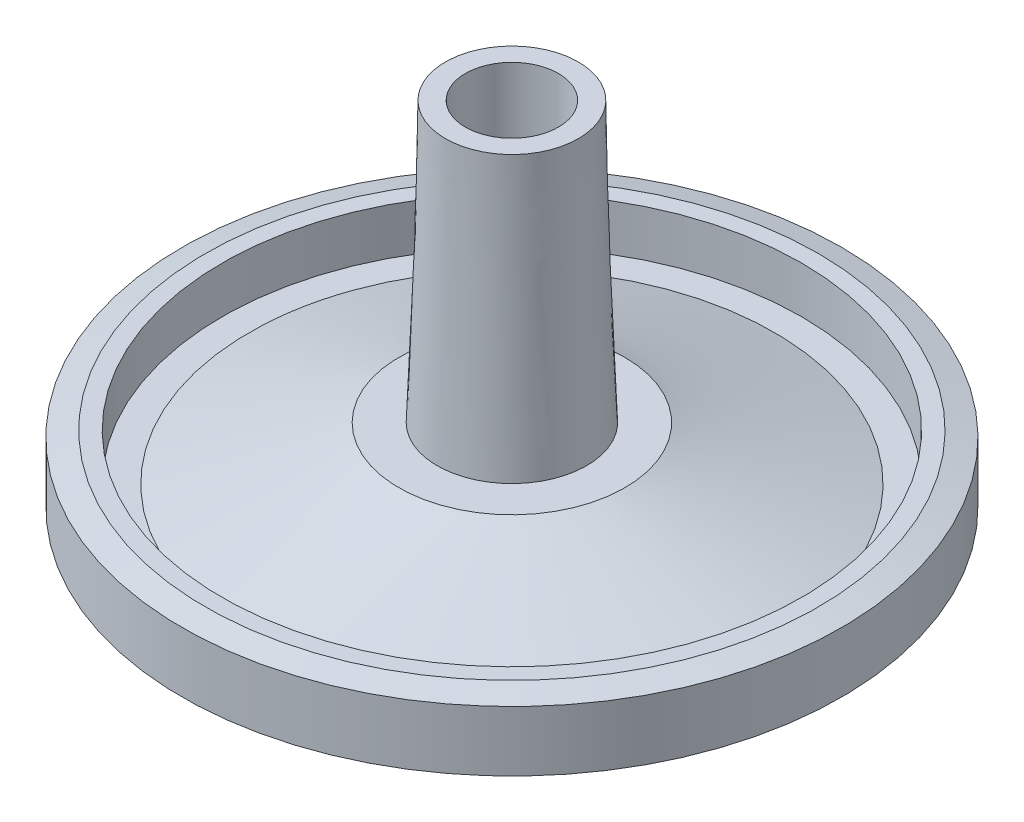
ISO-10303-21;
HEADER;
FILE_DESCRIPTION(('STEP AP214'),'2;1');
FILE_NAME('part.step','',(''),(''),'','','');
FILE_SCHEMA(('AUTOMOTIVE_DESIGN { 1 0 10303 214 1 1 1 1 }'));
ENDSEC;
DATA;
#1=APPLICATION_CONTEXT('core data for automotive mechanical design processes');
#2=APPLICATION_PROTOCOL_DEFINITION('international standard','automotive_design',2000,#1);
#3=PRODUCT_CONTEXT('',#1,'mechanical');
#4=PRODUCT('Part','Part','',(#3));
#5=PRODUCT_RELATED_PRODUCT_CATEGORY('part','',(#4));
#6=PRODUCT_DEFINITION_FORMATION('','',#4);
#7=PRODUCT_DEFINITION_CONTEXT('part definition',#1,'design');
#8=PRODUCT_DEFINITION('design','',#6,#7);
#9=PRODUCT_DEFINITION_SHAPE('','',#8);
#10=(LENGTH_UNIT() NAMED_UNIT(*) SI_UNIT(.MILLI.,.METRE.));
#11=(NAMED_UNIT(*) PLANE_ANGLE_UNIT() SI_UNIT($,.RADIAN.));
#12=(NAMED_UNIT(*) SI_UNIT($,.STERADIAN.) SOLID_ANGLE_UNIT());
#13=UNCERTAINTY_MEASURE_WITH_UNIT(LENGTH_MEASURE(1.E-05),#10,'distance_accuracy_value','');
#14=(GEOMETRIC_REPRESENTATION_CONTEXT(3) GLOBAL_UNCERTAINTY_ASSIGNED_CONTEXT((#13)) GLOBAL_UNIT_ASSIGNED_CONTEXT((#10,
#11,#12)) REPRESENTATION_CONTEXT('',''));
#15=CARTESIAN_POINT('',(0.,0.,0.));
#16=DIRECTION('',(0.,0.,1.));
#17=DIRECTION('',(1.,0.,0.));
#18=AXIS2_PLACEMENT_3D('',#15,#16,#17);
#19=CARTESIAN_POINT('',(0.,-26.5,0.));
#20=DIRECTION('',(0.,-1.,0.));
#21=DIRECTION('',(0.,0.,-1.));
#22=AXIS2_PLACEMENT_3D('',#19,#20,#21);
#23=PLANE('',#22);
#24=CARTESIAN_POINT('',(0.,-26.5,0.));
#25=DIRECTION('',(0.,-1.,0.));
#26=DIRECTION('',(0.,0.,-1.));
#27=AXIS2_PLACEMENT_3D('',#24,#25,#26);
#28=CIRCLE('',#27,23.);
#29=CARTESIAN_POINT('',(0.,-26.5,-23.));
#30=VERTEX_POINT('',#29);
#31=EDGE_CURVE('E60',#30,#30,#28,.F.);
#32=ORIENTED_EDGE('',*,*,#31,.T.);
#33=EDGE_LOOP('',(#32));
#34=FACE_BOUND('',#33,.T.);
#35=CARTESIAN_POINT('',(0.,-26.5,0.));
#36=DIRECTION('',(0.,-1.,0.));
#37=DIRECTION('',(0.,0.,-1.));
#38=AXIS2_PLACEMENT_3D('',#35,#36,#37);
#39=CIRCLE('',#38,24.8);
#40=CARTESIAN_POINT('',(0.,-26.5,-24.8));
#41=VERTEX_POINT('',#40);
#42=EDGE_CURVE('E129',#41,#41,#39,.T.);
#43=ORIENTED_EDGE('',*,*,#42,.T.);
#44=EDGE_LOOP('',(#43));
#45=FACE_BOUND('',#44,.T.);
#46=ADVANCED_FACE('F52',(#34,#45),#23,.T.);
#47=CARTESIAN_POINT('',(0.,-25.,0.));
#48=DIRECTION('',(0.,-1.,0.));
#49=DIRECTION('',(0.,0.,-1.));
#50=AXIS2_PLACEMENT_3D('',#47,#48,#49);
#51=PLANE('',#50);
#52=CARTESIAN_POINT('',(0.,-25.,0.));
#53=DIRECTION('',(0.,-1.,0.));
#54=DIRECTION('',(0.,0.,-1.));
#55=AXIS2_PLACEMENT_3D('',#52,#53,#54);
#56=CIRCLE('',#55,19.75);
#57=CARTESIAN_POINT('',(-17.8597529408905,-25.,-8.43159088727344));
#58=VERTEX_POINT('',#57);
#59=EDGE_CURVE('E132',#58,#58,#56,.T.);
#60=ORIENTED_EDGE('',*,*,#59,.T.);
#61=EDGE_LOOP('',(#60));
#62=FACE_BOUND('',#61,.T.);
#63=CARTESIAN_POINT('',(0.,-25.,0.));
#64=DIRECTION('',(0.,-1.,0.));
#65=DIRECTION('',(0.,0.,-1.));
#66=AXIS2_PLACEMENT_3D('',#63,#64,#65);
#67=CIRCLE('',#66,21.8);
#68=CARTESIAN_POINT('',(0.,-25.,-21.8));
#69=VERTEX_POINT('',#68);
#70=EDGE_CURVE('E237',#69,#69,#67,.T.);
#71=ORIENTED_EDGE('',*,*,#70,.F.);
#72=EDGE_LOOP('',(#71));
#73=FACE_BOUND('',#72,.T.);
#74=ADVANCED_FACE('F142',(#62,#73),#51,.F.);
#75=CARTESIAN_POINT('',(0.,0.,0.));
#76=DIRECTION('',(0.,1.,0.));
#77=DIRECTION('',(0.,0.,1.));
#78=AXIS2_PLACEMENT_3D('',#75,#76,#77);
#79=PLANE('',#78);
#80=CARTESIAN_POINT('',(0.,0.,0.));
#81=DIRECTION('',(0.,1.,0.));
#82=DIRECTION('',(0.,0.,1.));
#83=AXIS2_PLACEMENT_3D('',#80,#81,#82);
#84=CIRCLE('',#83,3.5);
#85=CARTESIAN_POINT('',(0.,0.,3.5));
#86=VERTEX_POINT('',#85);
#87=EDGE_CURVE('E187',#86,#86,#84,.T.);
#88=ORIENTED_EDGE('',*,*,#87,.F.);
#89=EDGE_LOOP('',(#88));
#90=FACE_BOUND('',#89,.T.);
#91=CARTESIAN_POINT('',(0.,0.,0.));
#92=DIRECTION('',(0.,1.,0.));
#93=DIRECTION('',(0.,0.,1.));
#94=AXIS2_PLACEMENT_3D('',#91,#92,#93);
#95=CIRCLE('',#94,5.);
#96=CARTESIAN_POINT('',(-3.03965148847302,0.,-3.96995199323918));
#97=VERTEX_POINT('',#96);
#98=EDGE_CURVE('E85',#97,#97,#95,.T.);
#99=ORIENTED_EDGE('',*,*,#98,.T.);
#100=EDGE_LOOP('',(#99));
#101=FACE_BOUND('',#100,.T.);
#102=ADVANCED_FACE('F152',(#90,#101),#79,.T.);
#103=CARTESIAN_POINT('',(-3.03965148847302,0.,-3.96995199323918));
#104=CARTESIAN_POINT('',(-4.7341345002537,-21.,-3.03786035451065));
#105=CARTESIAN_POINT('',(4.90025249800533,0.,-10.0492549701852));
#106=CARTESIAN_POINT('',(1.34158620876759,-21.,-12.5061293550181));
#107=CARTESIAN_POINT('',(10.9795554749514,0.,-2.10935098370688));
#108=CARTESIAN_POINT('',(10.809855209275,-21.,-6.43040864599678));
#109=CARTESIAN_POINT('',(3.03965148847302,0.,3.96995199323918));
#110=CARTESIAN_POINT('',(4.7341345002537,-21.,3.03786035451065));
#111=CARTESIAN_POINT('',(-4.90025249800535,0.,10.0492549701852));
#112=CARTESIAN_POINT('',(-1.3415862087676,-21.,12.5061293550181));
#113=CARTESIAN_POINT('',(-10.9795554749514,0.,2.10935098370687));
#114=CARTESIAN_POINT('',(-10.809855209275,-21.,6.43040864599676));
#115=CARTESIAN_POINT('',(-3.03965148847302,0.,-3.96995199323918));
#116=CARTESIAN_POINT('',(-4.7341345002537,-21.,-3.03786035451065));
#117=(BOUNDED_SURFACE() B_SPLINE_SURFACE(3,1,((#103,#104),(#105,#106),(#107,#108),(#109,#110),
(#111,#112),(#113,#114),(#115,#116)),.UNSPECIFIED.,.T.,.F.,.F.) B_SPLINE_SURFACE_WITH_KNOTS((4,
3,4),(2,2),(0.,0.5,1.),(0.,1.),
.UNSPECIFIED.) GEOMETRIC_REPRESENTATION_ITEM() RATIONAL_B_SPLINE_SURFACE(((1.,1.),
(0.333333333333333,0.333333333333333),(0.333333333333333,0.333333333333333),(1.,1.),
(0.333333333333334,0.333333333333333),(0.333333333333334,0.333333333333333),(1.,1.))) REPRESENTATION_ITEM('') SURFACE());
#118=CARTESIAN_POINT('',(0.,-21.,0.));
#119=DIRECTION('',(0.,1.,0.));
#120=DIRECTION('',(0.,0.,1.));
#121=AXIS2_PLACEMENT_3D('',#118,#119,#120);
#122=CIRCLE('',#121,5.625);
#123=CARTESIAN_POINT('',(-4.7341345002537,-21.,-3.03786035451065));
#124=VERTEX_POINT('',#123);
#125=EDGE_CURVE('E190',#124,#124,#122,.T.);
#126=CARTESIAN_POINT('',(-3.03965148847302,0.,-3.96995199323918));
#127=CARTESIAN_POINT('',(-3.05730235317907,-0.218750000000014,-3.96024270533576));
#128=CARTESIAN_POINT('',(-3.07495321788511,-0.437500000000014,-3.95053341743234));
#129=CARTESIAN_POINT('',(-3.11025494729721,-0.875000000000013,-3.9311148416255));
#130=CARTESIAN_POINT('',(-3.12790581200326,-1.09375000000001,-3.92140555372207));
#131=CARTESIAN_POINT('',(-3.16320754141536,-1.53125000000001,-3.90198697791523));
#132=CARTESIAN_POINT('',(-3.18085840612141,-1.75000000000001,-3.89227769001181));
#133=CARTESIAN_POINT('',(-3.2161601355335,-2.18750000000001,-3.87285911420496));
#134=CARTESIAN_POINT('',(-3.23381100023955,-2.40625000000001,-3.86314982630154));
#135=CARTESIAN_POINT('',(-3.26911272965165,-2.84375000000001,-3.8437312504947));
#136=CARTESIAN_POINT('',(-3.2867635943577,-3.06250000000001,-3.83402196259127));
#137=CARTESIAN_POINT('',(-3.3220653237698,-3.50000000000001,-3.81460338678443));
#138=CARTESIAN_POINT('',(-3.33971618847585,-3.71875000000001,-3.80489409888101));
#139=CARTESIAN_POINT('',(-3.37501791788794,-4.15625000000001,-3.78547552307416));
#140=CARTESIAN_POINT('',(-3.39266878259399,-4.37500000000001,-3.77576623517074));
#141=CARTESIAN_POINT('',(-3.42797051200609,-4.81250000000001,-3.75634765936389));
#142=CARTESIAN_POINT('',(-3.44562137671214,-5.03125000000001,-3.74663837146047));
#143=CARTESIAN_POINT('',(-3.48092310612424,-5.46875000000001,-3.72721979565363));
#144=CARTESIAN_POINT('',(-3.49857397083028,-5.68750000000001,-3.71751050775021));
#145=CARTESIAN_POINT('',(-3.53387570024238,-6.12500000000001,-3.69809193194336));
#146=CARTESIAN_POINT('',(-3.55152656494843,-6.34375000000001,-3.68838264403994));
#147=CARTESIAN_POINT('',(-3.58682829436053,-6.78125000000001,-3.66896406823309));
#148=CARTESIAN_POINT('',(-3.60447915906658,-7.00000000000001,-3.65925478032967));
#149=CARTESIAN_POINT('',(-3.63978088847868,-7.43750000000001,-3.63983620452283));
#150=CARTESIAN_POINT('',(-3.65743175318472,-7.65625000000001,-3.63012691661941));
#151=CARTESIAN_POINT('',(-3.69273348259682,-8.09375000000001,-3.61070834081256));
#152=CARTESIAN_POINT('',(-3.71038434730287,-8.31250000000001,-3.60099905290914));
#153=CARTESIAN_POINT('',(-3.74568607671497,-8.75000000000001,-3.58158047710229));
#154=CARTESIAN_POINT('',(-3.76333694142102,-8.96875000000001,-3.57187118919887));
#155=CARTESIAN_POINT('',(-3.79863867083311,-9.40625000000001,-3.55245261339203));
#156=CARTESIAN_POINT('',(-3.81628953553916,-9.62500000000001,-3.5427433254886));
#157=CARTESIAN_POINT('',(-3.85159126495126,-10.0625,-3.52332474968176));
#158=CARTESIAN_POINT('',(-3.86924212965731,-10.28125,-3.51361546177834));
#159=CARTESIAN_POINT('',(-3.90454385906941,-10.71875,-3.49419688597149));
#160=CARTESIAN_POINT('',(-3.92219472377546,-10.9375,-3.48448759806807));
#161=CARTESIAN_POINT('',(-3.95749645318755,-11.375,-3.46506902226123));
#162=CARTESIAN_POINT('',(-3.9751473178936,-11.59375,-3.4553597343578));
#163=CARTESIAN_POINT('',(-4.0104490473057,-12.03125,-3.43594115855096));
#164=CARTESIAN_POINT('',(-4.02809991201175,-12.25,-3.42623187064754));
#165=CARTESIAN_POINT('',(-4.06340164142385,-12.6875,-3.40681329484069));
#166=CARTESIAN_POINT('',(-4.0810525061299,-12.90625,-3.39710400693727));
#167=CARTESIAN_POINT('',(-4.11635423554199,-13.34375,-3.37768543113043));
#168=CARTESIAN_POINT('',(-4.13400510024804,-13.5625,-3.367976143227));
#169=CARTESIAN_POINT('',(-4.16930682966014,-14.,-3.34855756742016));
#170=CARTESIAN_POINT('',(-4.18695769436619,-14.21875,-3.33884827951674));
#171=CARTESIAN_POINT('',(-4.22225942377829,-14.65625,-3.31942970370989));
#172=CARTESIAN_POINT('',(-4.23991028848433,-14.875,-3.30972041580647));
#173=CARTESIAN_POINT('',(-4.27521201789643,-15.3125,-3.29030183999963));
#174=CARTESIAN_POINT('',(-4.29286288260248,-15.53125,-3.2805925520962));
#175=CARTESIAN_POINT('',(-4.32816461201458,-15.96875,-3.26117397628936));
#176=CARTESIAN_POINT('',(-4.34581547672063,-16.1875,-3.25146468838594));
#177=CARTESIAN_POINT('',(-4.38111720613272,-16.625,-3.23204611257909));
#178=CARTESIAN_POINT('',(-4.39876807083877,-16.84375,-3.22233682467567));
#179=CARTESIAN_POINT('',(-4.43406980025087,-17.28125,-3.20291824886883));
#180=CARTESIAN_POINT('',(-4.45172066495692,-17.5,-3.1932089609654));
#181=CARTESIAN_POINT('',(-4.48702239436902,-17.9375,-3.17379038515856));
#182=CARTESIAN_POINT('',(-4.50467325907507,-18.15625,-3.16408109725514));
#183=CARTESIAN_POINT('',(-4.53997498848716,-18.59375,-3.14466252144829));
#184=CARTESIAN_POINT('',(-4.55762585319321,-18.8125,-3.13495323354487));
#185=CARTESIAN_POINT('',(-4.59292758260531,-19.25,-3.11553465773802));
#186=CARTESIAN_POINT('',(-4.61057844731136,-19.46875,-3.1058253698346));
#187=CARTESIAN_POINT('',(-4.64588017672346,-19.90625,-3.08640679402776));
#188=CARTESIAN_POINT('',(-4.66353104142951,-20.125,-3.07669750612434));
#189=CARTESIAN_POINT('',(-4.6988327708416,-20.5625,-3.05727893031749));
#190=CARTESIAN_POINT('',(-4.71648363554765,-20.78125,-3.04756964241407));
#191=CARTESIAN_POINT('',(-4.7341345002537,-21.,-3.03786035451065));
#192=B_SPLINE_CURVE_WITH_KNOTS('',3,(#126,#127,#128,#129,#130,#131,#132,#133,#134,#135,#136,
#137,#138,#139,#140,#141,#142,#143,#144,#145,#146,#147,#148,#149,#150,#151,#152,#153,#154,#155,
#156,#157,#158,#159,#160,#161,#162,#163,#164,#165,#166,#167,#168,#169,#170,#171,#172,#173,#174,
#175,#176,#177,#178,#179,#180,#181,#182,#183,#184,#185,#186,#187,#188,#189,#190,#191),
.UNSPECIFIED.,.F.,.F.,(4,2,2,2,2,2,2,2,2,2,2,2,2,2,2,2,2,2,2,2,2,2,2,2,2,2,2,2,2,2,2,2,4),(0.,
0.659026913083346,1.31805382616669,1.97708073925004,2.63610765233339,3.29513456541673,
3.95416147850008,4.61318839158342,5.27221530466677,5.93124221775012,6.59026913083346,
7.24929604391681,7.90832295700015,8.5673498700835,9.22637678316685,9.88540369625019,
10.5444306093335,11.2034575224169,11.8624844355002,12.5215113485836,13.1805382616669,
13.8395651747503,14.4985920878336,15.157619000917,15.8166459140003,16.4756728270837,
17.134699740167,17.7937266532504,18.4527535663337,19.111780479417,19.7708073925004,
20.4298343055837,21.0888612186671),.UNSPECIFIED.);
#193=EDGE_CURVE('BSEAM201',#97,#124,#192,.T.);
#194=ORIENTED_EDGE('',*,*,#98,.F.);
#195=ORIENTED_EDGE('',*,*,#125,.T.);
#196=ORIENTED_EDGE('',*,*,#193,.T.);
#197=ORIENTED_EDGE('',*,*,#193,.F.);
#198=EDGE_LOOP('',(#194,#196,#195,#197));
#199=FACE_BOUND('',#198,.T.);
#200=ADVANCED_FACE('F201',(#199),#117,.T.);
#201=CARTESIAN_POINT('',(0.,-8.50000000000002,0.));
#202=DIRECTION('',(0.,1.,0.));
#203=DIRECTION('',(0.,0.,1.));
#204=AXIS2_PLACEMENT_3D('',#201,#202,#203);
#205=CYLINDRICAL_SURFACE('',#204,3.5);
#206=CARTESIAN_POINT('',(0.,-8.50000000000002,0.));
#207=DIRECTION('',(0.,1.,0.));
#208=DIRECTION('',(0.,0.,1.));
#209=AXIS2_PLACEMENT_3D('',#206,#207,#208);
#210=CIRCLE('',#209,3.5);
#211=CARTESIAN_POINT('',(0.,-8.50000000000002,3.5));
#212=VERTEX_POINT('',#211);
#213=EDGE_CURVE('E179',#212,#212,#210,.T.);
#214=ORIENTED_EDGE('',*,*,#213,.F.);
#215=EDGE_LOOP('',(#214));
#216=FACE_BOUND('',#215,.T.);
#217=ORIENTED_EDGE('',*,*,#87,.T.);
#218=EDGE_LOOP('',(#217));
#219=FACE_BOUND('',#218,.T.);
#220=ADVANCED_FACE('F213',(#216,#219),#205,.F.);
#221=CARTESIAN_POINT('',(0.,-8.50000000000002,0.));
#222=DIRECTION('',(0.,1.,0.));
#223=DIRECTION('',(0.,0.,1.));
#224=AXIS2_PLACEMENT_3D('',#221,#222,#223);
#225=PLANE('',#224);
#226=CARTESIAN_POINT('',(0.,-8.50000000000002,0.));
#227=DIRECTION('',(0.,1.,0.));
#228=DIRECTION('',(0.,0.,1.));
#229=AXIS2_PLACEMENT_3D('',#226,#227,#228);
#230=CIRCLE('',#229,2.5);
#231=CARTESIAN_POINT('',(0.,-8.50000000000002,2.5));
#232=VERTEX_POINT('',#231);
#233=EDGE_CURVE('E445',#232,#232,#230,.T.);
#234=ORIENTED_EDGE('',*,*,#233,.F.);
#235=EDGE_LOOP('',(#234));
#236=FACE_BOUND('',#235,.T.);
#237=ORIENTED_EDGE('',*,*,#213,.T.);
#238=EDGE_LOOP('',(#237));
#239=FACE_BOUND('',#238,.T.);
#240=ADVANCED_FACE('F166',(#236,#239),#225,.T.);
#241=CARTESIAN_POINT('',(0.,-21.,0.));
#242=DIRECTION('',(0.,-1.,0.));
#243=DIRECTION('',(0.,0.,-1.));
#244=AXIS2_PLACEMENT_3D('',#241,#242,#243);
#245=PLANE('',#244);
#246=CARTESIAN_POINT('',(0.,-21.,0.));
#247=DIRECTION('',(0.,-1.,0.));
#248=DIRECTION('',(0.,0.,-1.));
#249=AXIS2_PLACEMENT_3D('',#246,#247,#248);
#250=CIRCLE('',#249,8.5);
#251=CARTESIAN_POINT('',(-8.4929121419116,-21.,0.347049491817353));
#252=VERTEX_POINT('',#251);
#253=EDGE_CURVE('E500',#252,#252,#250,.T.);
#254=ORIENTED_EDGE('',*,*,#253,.F.);
#255=EDGE_LOOP('',(#254));
#256=FACE_BOUND('',#255,.T.);
#257=ORIENTED_EDGE('',*,*,#125,.F.);
#258=EDGE_LOOP('',(#257));
#259=FACE_BOUND('',#258,.T.);
#260=ADVANCED_FACE('F161',(#256,#259),#245,.F.);
#261=CARTESIAN_POINT('',(-8.4929121419116,-21.,0.347049491817353));
#262=CARTESIAN_POINT('',(-17.8597529408905,-25.,-8.43159088727344));
#263=CARTESIAN_POINT('',(-9.18701112554628,-21.,-16.6387747920058));
#264=CARTESIAN_POINT('',(-0.996571166343667,-25.,-44.1510967690545));
#265=CARTESIAN_POINT('',(7.7988131582769,-21.,-17.3328737756405));
#266=CARTESIAN_POINT('',(34.7229347154374,-25.,-27.2879149945076));
#267=CARTESIAN_POINT('',(8.49291214191159,-21.,-0.347049491817353));
#268=CARTESIAN_POINT('',(17.8597529408905,-25.,8.43159088727344));
#269=CARTESIAN_POINT('',(9.18701112554628,-21.,16.6387747920058));
#270=CARTESIAN_POINT('',(0.996571166343635,-25.,44.1510967690544));
#271=CARTESIAN_POINT('',(-7.79881315827691,-21.,17.3328737756405));
#272=CARTESIAN_POINT('',(-34.7229347154374,-25.,27.2879149945076));
#273=CARTESIAN_POINT('',(-8.4929121419116,-21.,0.347049491817353));
#274=CARTESIAN_POINT('',(-17.8597529408905,-25.,-8.43159088727344));
#275=(BOUNDED_SURFACE() B_SPLINE_SURFACE(3,1,((#261,#262),(#263,#264),(#265,#266),(#267,#268),
(#269,#270),(#271,#272),(#273,#274)),.UNSPECIFIED.,.T.,.F.,.F.) B_SPLINE_SURFACE_WITH_KNOTS((4,
3,4),(2,2),(0.,0.5,1.),(0.,1.),
.UNSPECIFIED.) GEOMETRIC_REPRESENTATION_ITEM() RATIONAL_B_SPLINE_SURFACE(((1.,1.),
(0.333333333333334,0.333333333333333),(0.333333333333334,0.333333333333333),(1.,1.),
(0.333333333333333,0.333333333333333),(0.333333333333333,0.333333333333333),(1.,1.))) REPRESENTATION_ITEM('') SURFACE());
#276=CARTESIAN_POINT('',(-8.4929121419116,-21.,0.347049491817353));
#277=CARTESIAN_POINT('',(-8.5904834002343,-21.0416666666667,0.255605321201824));
#278=CARTESIAN_POINT('',(-8.68805465855699,-21.0833333333333,0.164161150586295));
#279=CARTESIAN_POINT('',(-8.88319717520239,-21.1666666666667,-0.0187271906447636));
#280=CARTESIAN_POINT('',(-8.98076843352508,-21.2083333333333,-0.110171361260293));
#281=CARTESIAN_POINT('',(-9.17591095017048,-21.2916666666667,-0.293059702491351));
#282=CARTESIAN_POINT('',(-9.27348220849318,-21.3333333333333,-0.384503873106879));
#283=CARTESIAN_POINT('',(-9.46862472513857,-21.4166666666667,-0.567392214337938));
#284=CARTESIAN_POINT('',(-9.56619598346127,-21.4583333333333,-0.658836384953467));
#285=CARTESIAN_POINT('',(-9.76133850010666,-21.5416666666667,-0.841724726184525));
#286=CARTESIAN_POINT('',(-9.85890975842936,-21.5833333333333,-0.933168896800054));
#287=CARTESIAN_POINT('',(-10.0540522750748,-21.6666666666667,-1.11605723803111));
#288=CARTESIAN_POINT('',(-10.1516235333975,-21.7083333333333,-1.20750140864664));
#289=CARTESIAN_POINT('',(-10.3467660500428,-21.7916666666667,-1.3903897498777));
#290=CARTESIAN_POINT('',(-10.4443373083655,-21.8333333333333,-1.48183392049323));
#291=CARTESIAN_POINT('',(-10.6394798250109,-21.9166666666667,-1.66472226172429));
#292=CARTESIAN_POINT('',(-10.7370510833336,-21.9583333333333,-1.75616643233982));
#293=CARTESIAN_POINT('',(-10.932193599979,-22.0416666666667,-1.93905477357087));
#294=CARTESIAN_POINT('',(-11.0297648583017,-22.0833333333333,-2.0304989441864));
#295=CARTESIAN_POINT('',(-11.2249073749471,-22.1666666666667,-2.21338728541746));
#296=CARTESIAN_POINT('',(-11.3224786332698,-22.2083333333333,-2.30483145603299));
#297=CARTESIAN_POINT('',(-11.5176211499152,-22.2916666666667,-2.48771979726405));
#298=CARTESIAN_POINT('',(-11.6151924082379,-22.3333333333333,-2.57916396787958));
#299=CARTESIAN_POINT('',(-11.8103349248833,-22.4166666666667,-2.76205230911064));
#300=CARTESIAN_POINT('',(-11.907906183206,-22.4583333333333,-2.85349647972616));
#301=CARTESIAN_POINT('',(-12.1030486998514,-22.5416666666667,-3.03638482095722));
#302=CARTESIAN_POINT('',(-12.2006199581741,-22.5833333333333,-3.12782899157275));
#303=CARTESIAN_POINT('',(-12.3957624748195,-22.6666666666667,-3.31071733280381));
#304=CARTESIAN_POINT('',(-12.4933337331422,-22.7083333333333,-3.40216150341934));
#305=CARTESIAN_POINT('',(-12.6884762497876,-22.7916666666667,-3.5850498446504));
#306=CARTESIAN_POINT('',(-12.7860475081103,-22.8333333333333,-3.67649401526593));
#307=CARTESIAN_POINT('',(-12.9811900247557,-22.9166666666667,-3.85938235649698));
#308=CARTESIAN_POINT('',(-13.0787612830784,-22.9583333333333,-3.95082652711251));
#309=CARTESIAN_POINT('',(-13.2739037997238,-23.0416666666667,-4.13371486834357));
#310=CARTESIAN_POINT('',(-13.3714750580465,-23.0833333333333,-4.2251590389591));
#311=CARTESIAN_POINT('',(-13.5666175746919,-23.1666666666667,-4.40804738019016));
#312=CARTESIAN_POINT('',(-13.6641888330146,-23.2083333333333,-4.49949155080569));
#313=CARTESIAN_POINT('',(-13.8593313496599,-23.2916666666667,-4.68237989203675));
#314=CARTESIAN_POINT('',(-13.9569026079826,-23.3333333333333,-4.77382406265227));
#315=CARTESIAN_POINT('',(-14.152045124628,-23.4166666666667,-4.95671240388333));
#316=CARTESIAN_POINT('',(-14.2496163829507,-23.4583333333333,-5.04815657449886));
#317=CARTESIAN_POINT('',(-14.4447588995961,-23.5416666666667,-5.23104491572992));
#318=CARTESIAN_POINT('',(-14.5423301579188,-23.5833333333333,-5.32248908634545));
#319=CARTESIAN_POINT('',(-14.7374726745642,-23.6666666666667,-5.50537742757651));
#320=CARTESIAN_POINT('',(-14.8350439328869,-23.7083333333333,-5.59682159819204));
#321=CARTESIAN_POINT('',(-15.0301864495323,-23.7916666666667,-5.7797099394231));
#322=CARTESIAN_POINT('',(-15.127757707855,-23.8333333333333,-5.87115411003862));
#323=CARTESIAN_POINT('',(-15.3229002245004,-23.9166666666667,-6.05404245126968));
#324=CARTESIAN_POINT('',(-15.4204714828231,-23.9583333333333,-6.14548662188521));
#325=CARTESIAN_POINT('',(-15.6156139994685,-24.0416666666667,-6.32837496311627));
#326=CARTESIAN_POINT('',(-15.7131852577912,-24.0833333333333,-6.4198191337318));
#327=CARTESIAN_POINT('',(-15.9083277744366,-24.1666666666667,-6.60270747496286));
#328=CARTESIAN_POINT('',(-16.0058990327593,-24.2083333333333,-6.69415164557839));
#329=CARTESIAN_POINT('',(-16.2010415494047,-24.2916666666667,-6.87703998680944));
#330=CARTESIAN_POINT('',(-16.2986128077274,-24.3333333333333,-6.96848415742497));
#331=CARTESIAN_POINT('',(-16.4937553243728,-24.4166666666667,-7.15137249865603));
#332=CARTESIAN_POINT('',(-16.5913265826955,-24.4583333333333,-7.24281666927156));
#333=CARTESIAN_POINT('',(-16.7864690993409,-24.5416666666667,-7.42570501050262));
#334=CARTESIAN_POINT('',(-16.8840403576636,-24.5833333333333,-7.51714918111815));
#335=CARTESIAN_POINT('',(-17.079182874309,-24.6666666666667,-7.70003752234921));
#336=CARTESIAN_POINT('',(-17.1767541326317,-24.7083333333333,-7.79148169296473));
#337=CARTESIAN_POINT('',(-17.371896649277,-24.7916666666667,-7.97437003419579));
#338=CARTESIAN_POINT('',(-17.4694679075997,-24.8333333333333,-8.06581420481132));
#339=CARTESIAN_POINT('',(-17.6646104242451,-24.9166666666667,-8.24870254604238));
#340=CARTESIAN_POINT('',(-17.7621816825678,-24.9583333333333,-8.34014671665791));
#341=CARTESIAN_POINT('',(-17.8597529408905,-25.,-8.43159088727344));
#342=B_SPLINE_CURVE_WITH_KNOTS('',3,(#276,#277,#278,#279,#280,#281,#282,#283,#284,#285,#286,
#287,#288,#289,#290,#291,#292,#293,#294,#295,#296,#297,#298,#299,#300,#301,#302,#303,#304,#305,
#306,#307,#308,#309,#310,#311,#312,#313,#314,#315,#316,#317,#318,#319,#320,#321,#322,#323,#324,
#325,#326,#327,#328,#329,#330,#331,#332,#333,#334,#335,#336,#337,#338,#339,#340,#341),
.UNSPECIFIED.,.F.,.F.,(4,2,2,2,2,2,2,2,2,2,2,2,2,2,2,2,2,2,2,2,2,2,2,2,2,2,2,2,2,2,2,2,4),(0.,
0.42019600320818,0.840392006416359,1.26058800962454,1.68078401283272,2.1009800160409,
2.52117601924908,2.94137202245726,3.36156802566544,3.78176402887362,4.2019600320818,
4.62215603528998,5.04235203849816,5.46254804170634,5.88274404491452,6.30294004812269,
6.72313605133087,7.14333205453905,7.56352805774723,7.98372406095542,8.40392006416359,
8.82411606737177,9.24431207057995,9.66450807378813,10.0847040769963,10.5049000802045,
10.9250960834127,11.3452920866209,11.765488089829,12.1856840930372,12.6058800962454,
13.0260760994536,13.4462721026618),.UNSPECIFIED.);
#343=EDGE_CURVE('BSEAM165',#252,#58,#342,.T.);
#344=ORIENTED_EDGE('',*,*,#253,.T.);
#345=ORIENTED_EDGE('',*,*,#59,.F.);
#346=ORIENTED_EDGE('',*,*,#343,.T.);
#347=ORIENTED_EDGE('',*,*,#343,.F.);
#348=EDGE_LOOP('',(#344,#346,#345,#347));
#349=FACE_BOUND('',#348,.T.);
#350=ADVANCED_FACE('F165',(#349),#275,.T.);
#351=CARTESIAN_POINT('',(0.,-21.5,0.));
#352=DIRECTION('',(0.,-1.,0.));
#353=DIRECTION('',(0.,0.,-1.));
#354=AXIS2_PLACEMENT_3D('',#351,#352,#353);
#355=PLANE('',#354);
#356=CARTESIAN_POINT('',(0.,-21.5,0.));
#357=DIRECTION('',(0.,-1.,0.));
#358=DIRECTION('',(0.,0.,-1.));
#359=AXIS2_PLACEMENT_3D('',#356,#357,#358);
#360=CIRCLE('',#359,23.05);
#361=CARTESIAN_POINT('',(0.,-21.5,-23.05));
#362=VERTEX_POINT('',#361);
#363=EDGE_CURVE('E126',#362,#362,#360,.F.);
#364=ORIENTED_EDGE('',*,*,#363,.T.);
#365=EDGE_LOOP('',(#364));
#366=FACE_BOUND('',#365,.T.);
#367=CARTESIAN_POINT('',(0.,-21.5,0.));
#368=DIRECTION('',(0.,-1.,0.));
#369=DIRECTION('',(0.,0.,-1.));
#370=AXIS2_PLACEMENT_3D('',#367,#368,#369);
#371=CIRCLE('',#370,21.8);
#372=CARTESIAN_POINT('',(0.,-21.5,-21.8));
#373=VERTEX_POINT('',#372);
#374=EDGE_CURVE('E114',#373,#373,#371,.T.);
#375=ORIENTED_EDGE('',*,*,#374,.T.);
#376=EDGE_LOOP('',(#375));
#377=FACE_BOUND('',#376,.T.);
#378=ADVANCED_FACE('F289',(#366,#377),#355,.F.);
#379=CARTESIAN_POINT('',(0.,-21.5,0.));
#380=DIRECTION('',(0.,-1.,0.));
#381=DIRECTION('',(0.,0.,-1.));
#382=AXIS2_PLACEMENT_3D('',#379,#380,#381);
#383=CYLINDRICAL_SURFACE('',#382,21.8);
#384=ORIENTED_EDGE('',*,*,#374,.F.);
#385=EDGE_LOOP('',(#384));
#386=FACE_BOUND('',#385,.T.);
#387=ORIENTED_EDGE('',*,*,#70,.T.);
#388=EDGE_LOOP('',(#387));
#389=FACE_BOUND('',#388,.T.);
#390=ADVANCED_FACE('F286',(#386,#389),#383,.F.);
#391=CARTESIAN_POINT('',(0.,-21.9689110867545,0.));
#392=DIRECTION('',(0.,-1.,0.));
#393=DIRECTION('',(0.,0.,-1.));
#394=AXIS2_PLACEMENT_3D('',#391,#392,#393);
#395=CONICAL_SURFACE('',#394,24.8,1.30899693899575);
#396=ORIENTED_EDGE('',*,*,#363,.F.);
#397=EDGE_LOOP('',(#396));
#398=FACE_BOUND('',#397,.T.);
#399=CARTESIAN_POINT('',(0.,-21.9689110867545,0.));
#400=DIRECTION('',(0.,-1.,0.));
#401=DIRECTION('',(0.,0.,-1.));
#402=AXIS2_PLACEMENT_3D('',#399,#400,#401);
#403=CIRCLE('',#402,24.8);
#404=CARTESIAN_POINT('',(0.,-21.9689110867545,-24.8));
#405=VERTEX_POINT('',#404);
#406=EDGE_CURVE('E122',#405,#405,#403,.T.);
#407=ORIENTED_EDGE('',*,*,#406,.F.);
#408=EDGE_LOOP('',(#407));
#409=FACE_BOUND('',#408,.T.);
#410=ADVANCED_FACE('F159',(#398,#409),#395,.T.);
#411=CARTESIAN_POINT('',(0.,-26.5,0.));
#412=DIRECTION('',(0.,1.,0.));
#413=DIRECTION('',(0.,0.,1.));
#414=AXIS2_PLACEMENT_3D('',#411,#412,#413);
#415=CYLINDRICAL_SURFACE('',#414,24.8);
#416=ORIENTED_EDGE('',*,*,#42,.F.);
#417=EDGE_LOOP('',(#416));
#418=FACE_BOUND('',#417,.T.);
#419=ORIENTED_EDGE('',*,*,#406,.T.);
#420=EDGE_LOOP('',(#419));
#421=FACE_BOUND('',#420,.T.);
#422=ADVANCED_FACE('F155',(#418,#421),#415,.T.);
#423=CARTESIAN_POINT('',(0.,-27.5,0.));
#424=DIRECTION('',(0.,-1.,0.));
#425=DIRECTION('',(0.,0.,-1.));
#426=AXIS2_PLACEMENT_3D('',#423,#424,#425);
#427=PLANE('',#426);
#428=CARTESIAN_POINT('',(0.,-27.5,0.));
#429=DIRECTION('',(0.,-1.,0.));
#430=DIRECTION('',(0.,0.,-1.));
#431=AXIS2_PLACEMENT_3D('',#428,#429,#430);
#432=CIRCLE('',#431,22.);
#433=CARTESIAN_POINT('',(0.,-27.5,-22.));
#434=VERTEX_POINT('',#433);
#435=EDGE_CURVE('E65',#434,#434,#432,.T.);
#436=ORIENTED_EDGE('',*,*,#435,.T.);
#437=EDGE_LOOP('',(#436));
#438=FACE_BOUND('',#437,.T.);
#439=CARTESIAN_POINT('',(0.,-27.5,0.));
#440=DIRECTION('',(0.,-1.,0.));
#441=DIRECTION('',(0.,0.,-1.));
#442=AXIS2_PLACEMENT_3D('',#439,#440,#441);
#443=CIRCLE('',#442,21.);
#444=CARTESIAN_POINT('',(0.,-27.5,-21.));
#445=VERTEX_POINT('',#444);
#446=EDGE_CURVE('E245',#445,#445,#443,.F.);
#447=ORIENTED_EDGE('',*,*,#446,.T.);
#448=EDGE_LOOP('',(#447));
#449=FACE_BOUND('',#448,.T.);
#450=ADVANCED_FACE('F158',(#438,#449),#427,.T.);
#451=CARTESIAN_POINT('',(0.,-26.5,0.));
#452=DIRECTION('',(0.,-1.,0.));
#453=DIRECTION('',(0.,0.,-1.));
#454=AXIS2_PLACEMENT_3D('',#451,#452,#453);
#455=CIRCLE('',#454,20.);
#456=CARTESIAN_POINT('',(0.,-26.5,-20.));
#457=VERTEX_POINT('',#456);
#458=EDGE_CURVE('E13',#457,#457,#455,.T.);
#459=ORIENTED_EDGE('',*,*,#458,.T.);
#460=EDGE_LOOP('',(#459));
#461=FACE_BOUND('',#460,.T.);
#462=CARTESIAN_POINT('',(0.,-26.5,0.));
#463=DIRECTION('',(0.,-1.,0.));
#464=DIRECTION('',(0.,0.,-1.));
#465=AXIS2_PLACEMENT_3D('',#462,#463,#464);
#466=CIRCLE('',#465,19.5);
#467=CARTESIAN_POINT('',(0.,-26.5,-19.5));
#468=VERTEX_POINT('',#467);
#469=EDGE_CURVE('E72',#468,#468,#466,.T.);
#470=ORIENTED_EDGE('',*,*,#469,.F.);
#471=EDGE_LOOP('',(#470));
#472=FACE_BOUND('',#471,.T.);
#473=ADVANCED_FACE('F98',(#461,#472),#23,.T.);
#474=CARTESIAN_POINT('',(0.,-23.5,0.));
#475=DIRECTION('',(0.,-1.,0.));
#476=DIRECTION('',(0.,0.,-1.));
#477=AXIS2_PLACEMENT_3D('',#474,#475,#476);
#478=PLANE('',#477);
#479=CARTESIAN_POINT('',(0.,-23.5,0.));
#480=DIRECTION('',(0.,-1.,0.));
#481=DIRECTION('',(0.,0.,-1.));
#482=AXIS2_PLACEMENT_3D('',#479,#480,#481);
#483=CIRCLE('',#482,5.);
#484=CARTESIAN_POINT('',(-4.33535350582245,-23.5,-2.49092552669747));
#485=VERTEX_POINT('',#484);
#486=EDGE_CURVE('E76',#485,#485,#483,.T.);
#487=ORIENTED_EDGE('',*,*,#486,.F.);
#488=EDGE_LOOP('',(#487));
#489=FACE_BOUND('',#488,.T.);
#490=CARTESIAN_POINT('',(0.,-23.5,0.));
#491=DIRECTION('',(0.,-1.,0.));
#492=DIRECTION('',(0.,0.,-1.));
#493=AXIS2_PLACEMENT_3D('',#490,#491,#492);
#494=CIRCLE('',#493,9.5);
#495=CARTESIAN_POINT('',(0.,-23.5,-9.5));
#496=VERTEX_POINT('',#495);
#497=EDGE_CURVE('E123',#496,#496,#494,.T.);
#498=ORIENTED_EDGE('',*,*,#497,.T.);
#499=EDGE_LOOP('',(#498));
#500=FACE_BOUND('',#499,.T.);
#501=ADVANCED_FACE('F87',(#489,#500),#478,.T.);
#502=CARTESIAN_POINT('',(0.,-23.5,0.));
#503=DIRECTION('',(0.,-1.,0.));
#504=DIRECTION('',(0.,0.,-1.));
#505=AXIS2_PLACEMENT_3D('',#502,#503,#504);
#506=CONICAL_SURFACE('',#505,9.5,1.27933953231703);
#507=ORIENTED_EDGE('',*,*,#497,.F.);
#508=EDGE_LOOP('',(#507));
#509=FACE_BOUND('',#508,.T.);
#510=ORIENTED_EDGE('',*,*,#469,.T.);
#511=EDGE_LOOP('',(#510));
#512=FACE_BOUND('',#511,.T.);
#513=ADVANCED_FACE('F97',(#509,#512),#506,.F.);
#514=CARTESIAN_POINT('',(0.,-27.,0.));
#515=DIRECTION('',(0.,-1.,0.));
#516=DIRECTION('',(0.,0.,-1.));
#517=AXIS2_PLACEMENT_3D('',#514,#515,#516);
#518=TOROIDAL_SURFACE('',#517,23.,0.5);
#519=ORIENTED_EDGE('',*,*,#31,.F.);
#520=EDGE_LOOP('',(#519));
#521=FACE_BOUND('',#520,.T.);
#522=CARTESIAN_POINT('',(0.,-27.,0.));
#523=DIRECTION('',(0.,-1.,0.));
#524=DIRECTION('',(0.,0.,-1.));
#525=AXIS2_PLACEMENT_3D('',#522,#523,#524);
#526=CIRCLE('',#525,22.5);
#527=CARTESIAN_POINT('',(0.,-27.,-22.5));
#528=VERTEX_POINT('',#527);
#529=EDGE_CURVE('E69',#528,#528,#526,.T.);
#530=ORIENTED_EDGE('',*,*,#529,.F.);
#531=EDGE_LOOP('',(#530));
#532=FACE_BOUND('',#531,.T.);
#533=ADVANCED_FACE('F265',(#521,#532),#518,.F.);
#534=CARTESIAN_POINT('',(0.,-27.,0.));
#535=DIRECTION('',(0.,-1.,0.));
#536=DIRECTION('',(0.,0.,-1.));
#537=AXIS2_PLACEMENT_3D('',#534,#535,#536);
#538=TOROIDAL_SURFACE('',#537,22.,0.5);
#539=ORIENTED_EDGE('',*,*,#529,.T.);
#540=EDGE_LOOP('',(#539));
#541=FACE_BOUND('',#540,.T.);
#542=ORIENTED_EDGE('',*,*,#435,.F.);
#543=EDGE_LOOP('',(#542));
#544=FACE_BOUND('',#543,.T.);
#545=ADVANCED_FACE('F216',(#541,#544),#538,.T.);
#546=CARTESIAN_POINT('',(0.,-27.,0.));
#547=DIRECTION('',(0.,-1.,0.));
#548=DIRECTION('',(0.,0.,-1.));
#549=AXIS2_PLACEMENT_3D('',#546,#547,#548);
#550=TOROIDAL_SURFACE('',#549,20.,0.5);
#551=ORIENTED_EDGE('',*,*,#458,.F.);
#552=EDGE_LOOP('',(#551));
#553=FACE_BOUND('',#552,.T.);
#554=CARTESIAN_POINT('',(0.,-27.,0.));
#555=DIRECTION('',(0.,-1.,0.));
#556=DIRECTION('',(0.,0.,-1.));
#557=AXIS2_PLACEMENT_3D('',#554,#555,#556);
#558=CIRCLE('',#557,20.5);
#559=CARTESIAN_POINT('',(0.,-27.,-20.5));
#560=VERTEX_POINT('',#559);
#561=EDGE_CURVE('E73',#560,#560,#558,.F.);
#562=ORIENTED_EDGE('',*,*,#561,.F.);
#563=EDGE_LOOP('',(#562));
#564=FACE_BOUND('',#563,.T.);
#565=ADVANCED_FACE('F54',(#553,#564),#550,.F.);
#566=CARTESIAN_POINT('',(0.,-27.,0.));
#567=DIRECTION('',(0.,-1.,0.));
#568=DIRECTION('',(0.,0.,-1.));
#569=AXIS2_PLACEMENT_3D('',#566,#567,#568);
#570=TOROIDAL_SURFACE('',#569,21.,0.5);
#571=ORIENTED_EDGE('',*,*,#446,.F.);
#572=EDGE_LOOP('',(#571));
#573=FACE_BOUND('',#572,.T.);
#574=ORIENTED_EDGE('',*,*,#561,.T.);
#575=EDGE_LOOP('',(#574));
#576=FACE_BOUND('',#575,.T.);
#577=ADVANCED_FACE('F271',(#573,#576),#570,.T.);
#578=CARTESIAN_POINT('',(-4.33535350582245,-23.5,-2.49092552669747));
#579=CARTESIAN_POINT('',(-3.67256262126758,-19.5,0.758144968240421));
#580=CARTESIAN_POINT('',(-9.31720455921735,-23.5,6.17978148494742));
#581=CARTESIAN_POINT('',(-2.15627268478677,-19.5,8.10327021077555));
#582=CARTESIAN_POINT('',(-0.646497547572469,-23.5,11.1616325383423));
#583=CARTESIAN_POINT('',(5.18885255774838,-19.5,6.58698027429474));
#584=CARTESIAN_POINT('',(4.33535350582246,-23.5,2.49092552669747));
#585=CARTESIAN_POINT('',(3.67256262126757,-19.5,-0.758144968240393));
#586=CARTESIAN_POINT('',(9.31720455921736,-23.5,-6.17978148494743));
#587=CARTESIAN_POINT('',(2.15627268478678,-19.5,-8.10327021077554));
#588=CARTESIAN_POINT('',(0.646497547572449,-23.5,-11.1616325383424));
#589=CARTESIAN_POINT('',(-5.18885255774837,-19.5,-6.58698027429473));
#590=CARTESIAN_POINT('',(-4.33535350582245,-23.5,-2.49092552669747));
#591=CARTESIAN_POINT('',(-3.67256262126758,-19.5,0.758144968240421));
#592=(BOUNDED_SURFACE() B_SPLINE_SURFACE(3,1,((#578,#579),(#580,#581),(#582,#583),(#584,#585),
(#586,#587),(#588,#589),(#590,#591)),.UNSPECIFIED.,.T.,.F.,.F.) B_SPLINE_SURFACE_WITH_KNOTS((4,
3,4),(2,2),(0.,0.5,1.),(0.,1.),
.UNSPECIFIED.) GEOMETRIC_REPRESENTATION_ITEM() RATIONAL_B_SPLINE_SURFACE(((1.,1.),
(0.333333333333333,0.333333333333333),(0.333333333333333,0.333333333333333),(1.,1.),
(0.333333333333333,0.333333333333334),(0.333333333333333,0.333333333333334),(1.,1.))) REPRESENTATION_ITEM('') SURFACE());
#593=CARTESIAN_POINT('',(0.,-19.5,0.));
#594=DIRECTION('',(0.,-1.,0.));
#595=DIRECTION('',(0.,0.,-1.));
#596=AXIS2_PLACEMENT_3D('',#593,#594,#595);
#597=CIRCLE('',#596,3.75);
#598=CARTESIAN_POINT('',(-3.67256262126758,-19.5,0.758144968240421));
#599=VERTEX_POINT('',#598);
#600=EDGE_CURVE('E406',#599,#599,#597,.T.);
#601=CARTESIAN_POINT('',(-4.33535350582245,-23.5,-2.49092552669747));
#602=CARTESIAN_POINT('',(-4.32844943410833,-23.4583333333333,-2.4570810423752));
#603=CARTESIAN_POINT('',(-4.32154536239422,-23.4166666666667,-2.42323655805293));
#604=CARTESIAN_POINT('',(-4.30773721896599,-23.3333333333333,-2.35554758940839));
#605=CARTESIAN_POINT('',(-4.30083314725188,-23.2916666666667,-2.32170310508612));
#606=CARTESIAN_POINT('',(-4.28702500382365,-23.2083333333333,-2.25401413644158));
#607=CARTESIAN_POINT('',(-4.28012093210954,-23.1666666666667,-2.22016965211931));
#608=CARTESIAN_POINT('',(-4.26631278868132,-23.0833333333333,-2.15248068347477));
#609=CARTESIAN_POINT('',(-4.2594087169672,-23.0416666666667,-2.1186361991525));
#610=CARTESIAN_POINT('',(-4.24560057353898,-22.9583333333333,-2.05094723050796));
#611=CARTESIAN_POINT('',(-4.23869650182486,-22.9166666666667,-2.01710274618569));
#612=CARTESIAN_POINT('',(-4.22488835839664,-22.8333333333333,-1.94941377754115));
#613=CARTESIAN_POINT('',(-4.21798428668252,-22.7916666666667,-1.91556929321888));
#614=CARTESIAN_POINT('',(-4.2041761432543,-22.7083333333333,-1.84788032457434));
#615=CARTESIAN_POINT('',(-4.19727207154018,-22.6666666666667,-1.81403584025207));
#616=CARTESIAN_POINT('',(-4.18346392811196,-22.5833333333333,-1.74634687160754));
#617=CARTESIAN_POINT('',(-4.17655985639784,-22.5416666666667,-1.71250238728527));
#618=CARTESIAN_POINT('',(-4.16275171296962,-22.4583333333333,-1.64481341864073));
#619=CARTESIAN_POINT('',(-4.1558476412555,-22.4166666666667,-1.61096893431846));
#620=CARTESIAN_POINT('',(-4.14203949782728,-22.3333333333333,-1.54327996567392));
#621=CARTESIAN_POINT('',(-4.13513542611316,-22.2916666666667,-1.50943548135165));
#622=CARTESIAN_POINT('',(-4.12132728268494,-22.2083333333333,-1.44174651270711));
#623=CARTESIAN_POINT('',(-4.11442321097083,-22.1666666666667,-1.40790202838484));
#624=CARTESIAN_POINT('',(-4.1006150675426,-22.0833333333333,-1.3402130597403));
#625=CARTESIAN_POINT('',(-4.09371099582849,-22.0416666666667,-1.30636857541803));
#626=CARTESIAN_POINT('',(-4.07990285240026,-21.9583333333333,-1.23867960677349));
#627=CARTESIAN_POINT('',(-4.07299878068615,-21.9166666666667,-1.20483512245122));
#628=CARTESIAN_POINT('',(-4.05919063725792,-21.8333333333333,-1.13714615380668));
#629=CARTESIAN_POINT('',(-4.05228656554381,-21.7916666666667,-1.10330166948441));
#630=CARTESIAN_POINT('',(-4.03847842211558,-21.7083333333333,-1.03561270083987));
#631=CARTESIAN_POINT('',(-4.03157435040147,-21.6666666666667,-1.0017682165176));
#632=CARTESIAN_POINT('',(-4.01776620697324,-21.5833333333333,-0.934079247873063));
#633=CARTESIAN_POINT('',(-4.01086213525913,-21.5416666666667,-0.900234763550794));
#634=CARTESIAN_POINT('',(-3.9970539918309,-21.4583333333333,-0.832545794906254));
#635=CARTESIAN_POINT('',(-3.99014992011679,-21.4166666666667,-0.798701310583985));
#636=CARTESIAN_POINT('',(-3.97634177668856,-21.3333333333333,-0.731012341939445));
#637=CARTESIAN_POINT('',(-3.96943770497445,-21.2916666666667,-0.697167857617175));
#638=CARTESIAN_POINT('',(-3.95562956154622,-21.2083333333333,-0.629478888972636));
#639=CARTESIAN_POINT('',(-3.94872548983211,-21.1666666666667,-0.595634404650366));
#640=CARTESIAN_POINT('',(-3.93491734640388,-21.0833333333333,-0.527945436005827));
#641=CARTESIAN_POINT('',(-3.92801327468977,-21.0416666666667,-0.494100951683557));
#642=CARTESIAN_POINT('',(-3.91420513126154,-20.9583333333333,-0.426411983039018));
#643=CARTESIAN_POINT('',(-3.90730105954743,-20.9166666666667,-0.392567498716748));
#644=CARTESIAN_POINT('',(-3.8934929161192,-20.8333333333333,-0.324878530072209));
#645=CARTESIAN_POINT('',(-3.88658884440509,-20.7916666666667,-0.291034045749939));
#646=CARTESIAN_POINT('',(-3.87278070097686,-20.7083333333333,-0.2233450771054));
#647=CARTESIAN_POINT('',(-3.86587662926275,-20.6666666666667,-0.18950059278313));
#648=CARTESIAN_POINT('',(-3.85206848583453,-20.5833333333333,-0.121811624138591));
#649=CARTESIAN_POINT('',(-3.84516441412041,-20.5416666666667,-0.0879671398163213));
#650=CARTESIAN_POINT('',(-3.83135627069219,-20.4583333333333,-0.0202781711717819));
#651=CARTESIAN_POINT('',(-3.82445219897807,-20.4166666666667,0.0135663131504878));
#652=CARTESIAN_POINT('',(-3.81064405554985,-20.3333333333333,0.0812552817950271));
#653=CARTESIAN_POINT('',(-3.80373998383573,-20.2916666666667,0.115099766117297));
#654=CARTESIAN_POINT('',(-3.78993184040751,-20.2083333333333,0.182788734761836));
#655=CARTESIAN_POINT('',(-3.78302776869339,-20.1666666666667,0.216633219084106));
#656=CARTESIAN_POINT('',(-3.76921962526517,-20.0833333333333,0.284322187728645));
#657=CARTESIAN_POINT('',(-3.76231555355105,-20.0416666666667,0.318166672050915));
#658=CARTESIAN_POINT('',(-3.74850741012283,-19.9583333333333,0.385855640695454));
#659=CARTESIAN_POINT('',(-3.74160333840871,-19.9166666666667,0.419700125017724));
#660=CARTESIAN_POINT('',(-3.72779519498049,-19.8333333333333,0.487389093662263));
#661=CARTESIAN_POINT('',(-3.72089112326638,-19.7916666666667,0.521233577984533));
#662=CARTESIAN_POINT('',(-3.70708297983815,-19.7083333333333,0.588922546629072));
#663=CARTESIAN_POINT('',(-3.70017890812404,-19.6666666666667,0.622767030951342));
#664=CARTESIAN_POINT('',(-3.68637076469581,-19.5833333333333,0.690455999595881));
#665=CARTESIAN_POINT('',(-3.6794666929817,-19.5416666666667,0.724300483918151));
#666=CARTESIAN_POINT('',(-3.67256262126758,-19.5,0.758144968240421));
#667=B_SPLINE_CURVE_WITH_KNOTS('',3,(#601,#602,#603,#604,#605,#606,#607,#608,#609,#610,#611,
#612,#613,#614,#615,#616,#617,#618,#619,#620,#621,#622,#623,#624,#625,#626,#627,#628,#629,#630,
#631,#632,#633,#634,#635,#636,#637,#638,#639,#640,#641,#642,#643,#644,#645,#646,#647,#648,#649,
#650,#651,#652,#653,#654,#655,#656,#657,#658,#659,#660,#661,#662,#663,#664,#665,#666),
.UNSPECIFIED.,.F.,.F.,(4,2,2,2,2,2,2,2,2,2,2,2,2,2,2,2,2,2,2,2,2,2,2,2,2,2,2,2,2,2,2,2,4),(0.,
0.162366985337124,0.324733970674248,0.487100956011372,0.649467941348496,0.81183492668562,
0.974201912022743,1.13656889735987,1.29893588269699,1.46130286803412,1.62366985337124,
1.78603683870836,1.94840382404549,2.11077080938261,2.27313779471973,2.43550478005686,
2.59787176539398,2.76023875073111,2.92260573606823,3.08497272140535,3.24733970674248,
3.4097066920796,3.57207367741673,3.73444066275385,3.89680764809097,4.0591746334281,
4.22154161876522,4.38390860410235,4.54627558943947,4.7086425747766,4.87100956011372,
5.03337654545084,5.19574353078797),.UNSPECIFIED.);
#668=EDGE_CURVE('BSEAM99',#485,#599,#667,.T.);
#669=ORIENTED_EDGE('',*,*,#486,.T.);
#670=ORIENTED_EDGE('',*,*,#600,.F.);
#671=ORIENTED_EDGE('',*,*,#668,.T.);
#672=ORIENTED_EDGE('',*,*,#668,.F.);
#673=EDGE_LOOP('',(#669,#671,#670,#672));
#674=FACE_BOUND('',#673,.T.);
#675=ADVANCED_FACE('F99',(#674),#592,.F.);
#676=CARTESIAN_POINT('',(0.,-10.,0.));
#677=DIRECTION('',(0.,-1.,0.));
#678=DIRECTION('',(0.,0.,-1.));
#679=AXIS2_PLACEMENT_3D('',#676,#677,#678);
#680=CYLINDRICAL_SURFACE('',#679,3.75);
#681=CARTESIAN_POINT('',(0.,-10.,0.));
#682=DIRECTION('',(0.,-1.,0.));
#683=DIRECTION('',(0.,0.,-1.));
#684=AXIS2_PLACEMENT_3D('',#681,#682,#683);
#685=CIRCLE('',#684,3.75);
#686=CARTESIAN_POINT('',(0.,-10.,-3.75));
#687=VERTEX_POINT('',#686);
#688=EDGE_CURVE('E442',#687,#687,#685,.T.);
#689=ORIENTED_EDGE('',*,*,#688,.F.);
#690=EDGE_LOOP('',(#689));
#691=FACE_BOUND('',#690,.T.);
#692=ORIENTED_EDGE('',*,*,#600,.T.);
#693=EDGE_LOOP('',(#692));
#694=FACE_BOUND('',#693,.T.);
#695=ADVANCED_FACE('F355',(#691,#694),#680,.F.);
#696=CARTESIAN_POINT('',(0.,-10.,0.));
#697=DIRECTION('',(0.,-1.,0.));
#698=DIRECTION('',(0.,0.,-1.));
#699=AXIS2_PLACEMENT_3D('',#696,#697,#698);
#700=PLANE('',#699);
#701=CARTESIAN_POINT('',(0.,-10.,0.));
#702=DIRECTION('',(0.,-1.,0.));
#703=DIRECTION('',(0.,0.,-1.));
#704=AXIS2_PLACEMENT_3D('',#701,#702,#703);
#705=CIRCLE('',#704,2.5);
#706=CARTESIAN_POINT('',(0.,-10.,-2.5));
#707=VERTEX_POINT('',#706);
#708=EDGE_CURVE('E448',#707,#707,#705,.T.);
#709=ORIENTED_EDGE('',*,*,#708,.F.);
#710=EDGE_LOOP('',(#709));
#711=FACE_BOUND('',#710,.T.);
#712=ORIENTED_EDGE('',*,*,#688,.T.);
#713=EDGE_LOOP('',(#712));
#714=FACE_BOUND('',#713,.T.);
#715=ADVANCED_FACE('F362',(#711,#714),#700,.T.);
#716=CARTESIAN_POINT('',(0.,0.00210000000000488,0.));
#717=DIRECTION('',(0.,-1.,0.));
#718=DIRECTION('',(0.,0.,-1.));
#719=AXIS2_PLACEMENT_3D('',#716,#717,#718);
#720=CYLINDRICAL_SURFACE('',#719,2.5);
#721=ORIENTED_EDGE('',*,*,#233,.T.);
#722=EDGE_LOOP('',(#721));
#723=FACE_BOUND('',#722,.T.);
#724=ORIENTED_EDGE('',*,*,#708,.T.);
#725=EDGE_LOOP('',(#724));
#726=FACE_BOUND('',#725,.T.);
#727=ADVANCED_FACE('F369',(#723,#726),#720,.F.);
#728=CLOSED_SHELL('',(#46,#74,#102,#200,#220,#240,#260,#350,#378,#390,#410,#422,#450,#473,#501,
#513,#533,#545,#565,#577,#675,#695,#715,#727));
#729=MANIFOLD_SOLID_BREP('B2',#728);
#730=ADVANCED_BREP_SHAPE_REPRESENTATION('',(#18,#729),#14);
#731=SHAPE_DEFINITION_REPRESENTATION(#9,#730);
ENDSEC;
END-ISO-10303-21;
